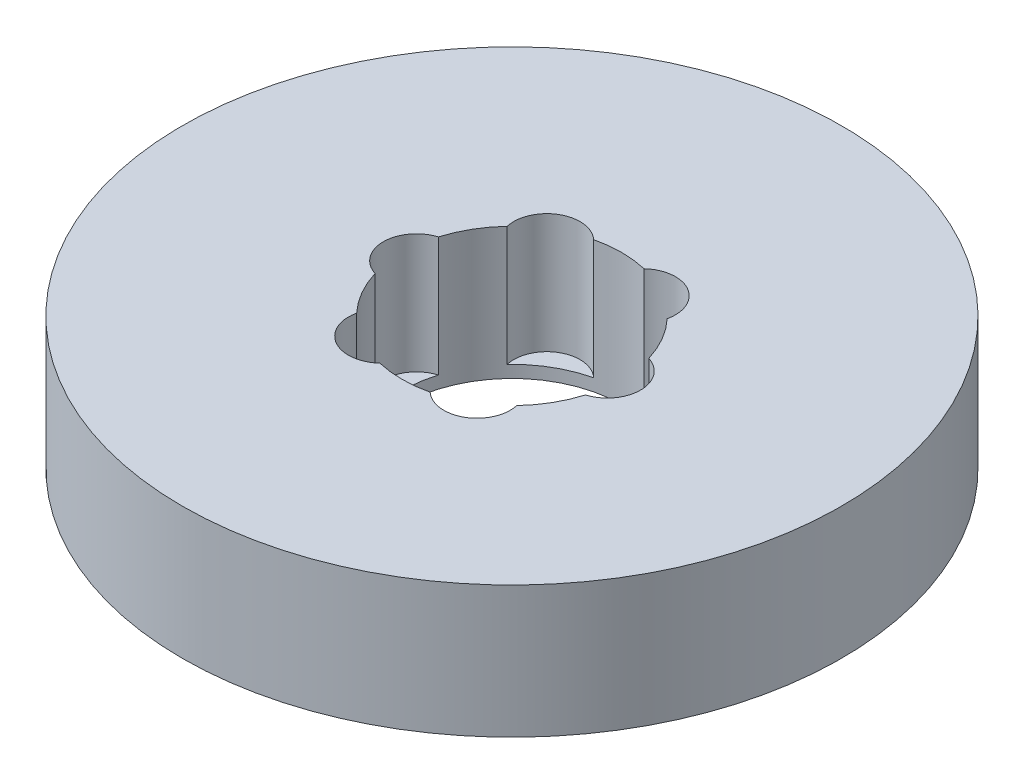
ISO-10303-21;
HEADER;
FILE_DESCRIPTION(('STEP AP214'),'2;1');
FILE_NAME('part.step','',(''),(''),'','','');
FILE_SCHEMA(('AUTOMOTIVE_DESIGN { 1 0 10303 214 1 1 1 1 }'));
ENDSEC;
DATA;
#1=APPLICATION_CONTEXT('core data for automotive mechanical design processes');
#2=APPLICATION_PROTOCOL_DEFINITION('international standard','automotive_design',2000,#1);
#3=PRODUCT_CONTEXT('',#1,'mechanical');
#4=PRODUCT('Part','Part','',(#3));
#5=PRODUCT_RELATED_PRODUCT_CATEGORY('part','',(#4));
#6=PRODUCT_DEFINITION_FORMATION('','',#4);
#7=PRODUCT_DEFINITION_CONTEXT('part definition',#1,'design');
#8=PRODUCT_DEFINITION('design','',#6,#7);
#9=PRODUCT_DEFINITION_SHAPE('','',#8);
#10=(LENGTH_UNIT() NAMED_UNIT(*) SI_UNIT(.MILLI.,.METRE.));
#11=(NAMED_UNIT(*) PLANE_ANGLE_UNIT() SI_UNIT($,.RADIAN.));
#12=(NAMED_UNIT(*) SI_UNIT($,.STERADIAN.) SOLID_ANGLE_UNIT());
#13=UNCERTAINTY_MEASURE_WITH_UNIT(LENGTH_MEASURE(1.E-05),#10,'distance_accuracy_value','');
#14=(GEOMETRIC_REPRESENTATION_CONTEXT(3) GLOBAL_UNCERTAINTY_ASSIGNED_CONTEXT((#13)) GLOBAL_UNIT_ASSIGNED_CONTEXT((#10,
#11,#12)) REPRESENTATION_CONTEXT('',''));
#15=CARTESIAN_POINT('',(0.,0.,0.));
#16=DIRECTION('',(0.,0.,1.));
#17=DIRECTION('',(1.,0.,0.));
#18=AXIS2_PLACEMENT_3D('',#15,#16,#17);
#19=CARTESIAN_POINT('',(0.,18.,0.));
#20=DIRECTION('',(0.,-1.,0.));
#21=DIRECTION('',(0.,0.,-1.));
#22=AXIS2_PLACEMENT_3D('',#19,#20,#21);
#23=CYLINDRICAL_SURFACE('',#22,45.);
#24=CARTESIAN_POINT('',(0.,18.,0.));
#25=DIRECTION('',(0.,1.,0.));
#26=DIRECTION('',(0.,0.,1.));
#27=AXIS2_PLACEMENT_3D('',#24,#25,#26);
#28=CIRCLE('',#27,45.);
#29=CARTESIAN_POINT('',(0.,18.,45.));
#30=VERTEX_POINT('',#29);
#31=EDGE_CURVE('E162',#30,#30,#28,.T.);
#32=ORIENTED_EDGE('',*,*,#31,.F.);
#33=EDGE_LOOP('',(#32));
#34=FACE_BOUND('',#33,.T.);
#35=CARTESIAN_POINT('',(0.,0.,0.));
#36=DIRECTION('',(0.,1.,0.));
#37=DIRECTION('',(0.,0.,1.));
#38=AXIS2_PLACEMENT_3D('',#35,#36,#37);
#39=CIRCLE('',#38,45.);
#40=CARTESIAN_POINT('',(0.,0.,45.));
#41=VERTEX_POINT('',#40);
#42=EDGE_CURVE('E157',#41,#41,#39,.T.);
#43=ORIENTED_EDGE('',*,*,#42,.T.);
#44=EDGE_LOOP('',(#43));
#45=FACE_BOUND('',#44,.T.);
#46=ADVANCED_FACE('F39',(#34,#45),#23,.T.);
#47=CARTESIAN_POINT('',(0.,18.,0.));
#48=DIRECTION('',(0.,1.,0.));
#49=DIRECTION('',(0.,0.,1.));
#50=AXIS2_PLACEMENT_3D('',#47,#48,#49);
#51=PLANE('',#50);
#52=CARTESIAN_POINT('',(-6.51524168863489,18.,-11.2847296283062));
#53=DIRECTION('',(0.,1.,0.));
#54=DIRECTION('',(-0.866025403784433,0.,0.50000000000001));
#55=AXIS2_PLACEMENT_3D('',#52,#53,#54);
#56=CIRCLE('',#55,4.52626027528918);
#57=CARTESIAN_POINT('',(-3.43514698347195,18.,-14.601361758478));
#58=VERTEX_POINT('',#57);
#59=CARTESIAN_POINT('',(-10.9275767209528,18.,-10.2756054326589));
#60=VERTEX_POINT('',#59);
#61=EDGE_CURVE('E218',#58,#60,#56,.T.);
#62=ORIENTED_EDGE('',*,*,#61,.F.);
#63=CARTESIAN_POINT('',(0.,18.,0.));
#64=DIRECTION('',(0.,1.,0.));
#65=DIRECTION('',(0.,0.,1.));
#66=AXIS2_PLACEMENT_3D('',#63,#64,#65);
#67=CIRCLE('',#66,15.);
#68=CARTESIAN_POINT('',(3.43514698347164,18.,-14.6013617584781));
#69=VERTEX_POINT('',#68);
#70=EDGE_CURVE('E169',#69,#58,#67,.T.);
#71=ORIENTED_EDGE('',*,*,#70,.F.);
#72=CARTESIAN_POINT('',(6.51524168863465,18.,-11.2847296283063));
#73=DIRECTION('',(0.,1.,0.));
#74=DIRECTION('',(-0.866025403784443,0.,-0.499999999999992));
#75=AXIS2_PLACEMENT_3D('',#72,#73,#74);
#76=CIRCLE('',#75,4.52626027528918);
#77=CARTESIAN_POINT('',(10.9275767209526,18.,-10.2756054326592));
#78=VERTEX_POINT('',#77);
#79=EDGE_CURVE('E285',#78,#69,#76,.T.);
#80=ORIENTED_EDGE('',*,*,#79,.F.);
#81=CARTESIAN_POINT('',(14.3627237044245,18.,-4.32575632581898));
#82=VERTEX_POINT('',#81);
#83=EDGE_CURVE('E174',#82,#78,#67,.T.);
#84=ORIENTED_EDGE('',*,*,#83,.F.);
#85=CARTESIAN_POINT('',(13.0304833772695,18.,0.));
#86=DIRECTION('',(0.,1.,0.));
#87=DIRECTION('',(0.,0.,-1.));
#88=AXIS2_PLACEMENT_3D('',#85,#86,#87);
#89=CIRCLE('',#88,4.52626027528918);
#90=CARTESIAN_POINT('',(14.3627237044245,18.,4.32575632581898));
#91=VERTEX_POINT('',#90);
#92=EDGE_CURVE('E280',#91,#82,#89,.T.);
#93=ORIENTED_EDGE('',*,*,#92,.F.);
#94=CARTESIAN_POINT('',(10.9275767209528,18.,10.275605432659));
#95=VERTEX_POINT('',#94);
#96=EDGE_CURVE('E164',#95,#91,#67,.T.);
#97=ORIENTED_EDGE('',*,*,#96,.F.);
#98=CARTESIAN_POINT('',(6.51524168863481,18.,11.2847296283062));
#99=DIRECTION('',(0.,1.,0.));
#100=DIRECTION('',(0.866025403784436,0.,-0.500000000000004));
#101=AXIS2_PLACEMENT_3D('',#98,#99,#100);
#102=CIRCLE('',#101,4.52626027528918);
#103=CARTESIAN_POINT('',(3.43514698347184,18.,14.601361758478));
#104=VERTEX_POINT('',#103);
#105=EDGE_CURVE('E269',#104,#95,#102,.T.);
#106=ORIENTED_EDGE('',*,*,#105,.F.);
#107=CARTESIAN_POINT('',(-3.43514698347174,18.,14.601361758478));
#108=VERTEX_POINT('',#107);
#109=EDGE_CURVE('E149',#108,#104,#67,.T.);
#110=ORIENTED_EDGE('',*,*,#109,.F.);
#111=CARTESIAN_POINT('',(-6.51524168863473,18.,11.2847296283063));
#112=DIRECTION('',(0.,1.,0.));
#113=DIRECTION('',(0.86602540378444,0.,0.499999999999998));
#114=AXIS2_PLACEMENT_3D('',#111,#112,#113);
#115=CIRCLE('',#114,4.52626027528918);
#116=CARTESIAN_POINT('',(-10.9275767209527,18.,10.2756054326591));
#117=VERTEX_POINT('',#116);
#118=EDGE_CURVE('E128',#117,#108,#115,.T.);
#119=ORIENTED_EDGE('',*,*,#118,.F.);
#120=CARTESIAN_POINT('',(-14.3627237044245,18.,4.32575632581898));
#121=VERTEX_POINT('',#120);
#122=EDGE_CURVE('E148',#121,#117,#67,.T.);
#123=ORIENTED_EDGE('',*,*,#122,.F.);
#124=CARTESIAN_POINT('',(-13.0304833772695,18.,0.));
#125=DIRECTION('',(0.,1.,0.));
#126=DIRECTION('',(0.,0.,1.));
#127=AXIS2_PLACEMENT_3D('',#124,#125,#126);
#128=CIRCLE('',#127,4.52626027528918);
#129=CARTESIAN_POINT('',(-14.3627237044245,18.,-4.32575632581898));
#130=VERTEX_POINT('',#129);
#131=EDGE_CURVE('E179',#130,#121,#128,.T.);
#132=ORIENTED_EDGE('',*,*,#131,.F.);
#133=EDGE_CURVE('E161',#60,#130,#67,.T.);
#134=ORIENTED_EDGE('',*,*,#133,.F.);
#135=EDGE_LOOP('',(#62,#71,#80,#84,#93,#97,#106,#110,#119,#123,#132,#134));
#136=FACE_BOUND('',#135,.T.);
#137=ORIENTED_EDGE('',*,*,#31,.T.);
#138=EDGE_LOOP('',(#137));
#139=FACE_BOUND('',#138,.T.);
#140=ADVANCED_FACE('F141',(#136,#139),#51,.T.);
#141=CARTESIAN_POINT('',(0.,0.,0.));
#142=DIRECTION('',(0.,1.,0.));
#143=DIRECTION('',(0.,0.,1.));
#144=AXIS2_PLACEMENT_3D('',#141,#142,#143);
#145=PLANE('',#144);
#146=CARTESIAN_POINT('',(0.,0.,0.));
#147=DIRECTION('',(0.,1.,0.));
#148=DIRECTION('',(0.,0.,1.));
#149=AXIS2_PLACEMENT_3D('',#146,#147,#148);
#150=CIRCLE('',#149,15.);
#151=CARTESIAN_POINT('',(0.,0.,15.));
#152=VERTEX_POINT('',#151);
#153=EDGE_CURVE('E166',#152,#152,#150,.T.);
#154=ORIENTED_EDGE('',*,*,#153,.T.);
#155=EDGE_LOOP('',(#154));
#156=FACE_BOUND('',#155,.T.);
#157=ORIENTED_EDGE('',*,*,#42,.F.);
#158=EDGE_LOOP('',(#157));
#159=FACE_BOUND('',#158,.T.);
#160=ADVANCED_FACE('F234',(#156,#159),#145,.F.);
#161=CARTESIAN_POINT('',(0.,18.,0.));
#162=DIRECTION('',(0.,-1.,0.));
#163=DIRECTION('',(0.,0.,-1.));
#164=AXIS2_PLACEMENT_3D('',#161,#162,#163);
#165=CYLINDRICAL_SURFACE('',#164,15.);
#166=DIRECTION('',(0.,1.,0.));
#167=VECTOR('',#166,1.);
#168=CARTESIAN_POINT('',(-3.43514698347195,9.83649902782655,-14.601361758478));
#169=LINE('',#168,#167);
#170=CARTESIAN_POINT('',(-3.43514698347195,1.6729980556531,-14.601361758478));
#171=VERTEX_POINT('',#170);
#172=EDGE_CURVE('E11',#171,#58,#169,.T.);
#173=ORIENTED_EDGE('',*,*,#172,.F.);
#174=CARTESIAN_POINT('',(0.,1.6729980556531,0.));
#175=DIRECTION('',(0.,1.,0.));
#176=DIRECTION('',(0.,0.,1.));
#177=AXIS2_PLACEMENT_3D('',#174,#175,#176);
#178=CIRCLE('',#177,15.);
#179=CARTESIAN_POINT('',(-10.9275767209528,1.6729980556531,-10.2756054326589));
#180=VERTEX_POINT('',#179);
#181=EDGE_CURVE('E214',#171,#180,#178,.T.);
#182=ORIENTED_EDGE('',*,*,#181,.T.);
#183=DIRECTION('',(0.,1.,0.));
#184=VECTOR('',#183,1.);
#185=CARTESIAN_POINT('',(-10.9275767209528,9.83649902782655,-10.2756054326589));
#186=LINE('',#185,#184);
#187=EDGE_CURVE('E46',#60,#180,#186,.F.);
#188=ORIENTED_EDGE('',*,*,#187,.F.);
#189=ORIENTED_EDGE('',*,*,#133,.T.);
#190=DIRECTION('',(0.,1.,0.));
#191=VECTOR('',#190,1.);
#192=CARTESIAN_POINT('',(-14.3627237044245,9.83649902782655,-4.32575632581898));
#193=LINE('',#192,#191);
#194=CARTESIAN_POINT('',(-14.3627237044245,1.6729980556531,-4.32575632581898));
#195=VERTEX_POINT('',#194);
#196=EDGE_CURVE('E187',#195,#130,#193,.T.);
#197=ORIENTED_EDGE('',*,*,#196,.F.);
#198=CARTESIAN_POINT('',(0.,1.6729980556531,0.));
#199=DIRECTION('',(0.,1.,0.));
#200=DIRECTION('',(0.,0.,1.));
#201=AXIS2_PLACEMENT_3D('',#198,#199,#200);
#202=CIRCLE('',#201,15.);
#203=CARTESIAN_POINT('',(-14.3627237044245,1.6729980556531,4.32575632581898));
#204=VERTEX_POINT('',#203);
#205=EDGE_CURVE('E184',#195,#204,#202,.T.);
#206=ORIENTED_EDGE('',*,*,#205,.T.);
#207=DIRECTION('',(0.,1.,0.));
#208=VECTOR('',#207,1.);
#209=CARTESIAN_POINT('',(-14.3627237044245,9.83649902782655,4.32575632581898));
#210=LINE('',#209,#208);
#211=EDGE_CURVE('E158',#121,#204,#210,.F.);
#212=ORIENTED_EDGE('',*,*,#211,.F.);
#213=ORIENTED_EDGE('',*,*,#122,.T.);
#214=DIRECTION('',(0.,1.,0.));
#215=VECTOR('',#214,1.);
#216=CARTESIAN_POINT('',(-10.9275767209527,9.83649902782655,10.2756054326591));
#217=LINE('',#216,#215);
#218=CARTESIAN_POINT('',(-10.9275767209527,1.6729980556531,10.2756054326591));
#219=VERTEX_POINT('',#218);
#220=EDGE_CURVE('E127',#219,#117,#217,.T.);
#221=ORIENTED_EDGE('',*,*,#220,.F.);
#222=CARTESIAN_POINT('',(0.,1.6729980556531,0.));
#223=DIRECTION('',(0.,1.,0.));
#224=DIRECTION('',(0.,0.,1.));
#225=AXIS2_PLACEMENT_3D('',#222,#223,#224);
#226=CIRCLE('',#225,15.);
#227=CARTESIAN_POINT('',(-3.43514698347174,1.6729980556531,14.601361758478));
#228=VERTEX_POINT('',#227);
#229=EDGE_CURVE('E189',#219,#228,#226,.T.);
#230=ORIENTED_EDGE('',*,*,#229,.T.);
#231=DIRECTION('',(0.,1.,0.));
#232=VECTOR('',#231,1.);
#233=CARTESIAN_POINT('',(-3.43514698347174,9.83649902782655,14.601361758478));
#234=LINE('',#233,#232);
#235=EDGE_CURVE('E140',#108,#228,#234,.F.);
#236=ORIENTED_EDGE('',*,*,#235,.F.);
#237=ORIENTED_EDGE('',*,*,#109,.T.);
#238=DIRECTION('',(0.,1.,0.));
#239=VECTOR('',#238,1.);
#240=CARTESIAN_POINT('',(3.43514698347184,9.83649902782655,14.601361758478));
#241=LINE('',#240,#239);
#242=CARTESIAN_POINT('',(3.43514698347184,1.6729980556531,14.601361758478));
#243=VERTEX_POINT('',#242);
#244=EDGE_CURVE('E196',#243,#104,#241,.T.);
#245=ORIENTED_EDGE('',*,*,#244,.F.);
#246=CARTESIAN_POINT('',(0.,1.6729980556531,0.));
#247=DIRECTION('',(0.,1.,0.));
#248=DIRECTION('',(0.,0.,1.));
#249=AXIS2_PLACEMENT_3D('',#246,#247,#248);
#250=CIRCLE('',#249,15.);
#251=CARTESIAN_POINT('',(10.9275767209528,1.6729980556531,10.275605432659));
#252=VERTEX_POINT('',#251);
#253=EDGE_CURVE('E136',#243,#252,#250,.T.);
#254=ORIENTED_EDGE('',*,*,#253,.T.);
#255=DIRECTION('',(0.,1.,0.));
#256=VECTOR('',#255,1.);
#257=CARTESIAN_POINT('',(10.9275767209528,9.83649902782655,10.275605432659));
#258=LINE('',#257,#256);
#259=EDGE_CURVE('E194',#95,#252,#258,.F.);
#260=ORIENTED_EDGE('',*,*,#259,.F.);
#261=ORIENTED_EDGE('',*,*,#96,.T.);
#262=DIRECTION('',(0.,1.,0.));
#263=VECTOR('',#262,1.);
#264=CARTESIAN_POINT('',(14.3627237044245,9.83649902782655,4.32575632581898));
#265=LINE('',#264,#263);
#266=CARTESIAN_POINT('',(14.3627237044245,1.6729980556531,4.32575632581898));
#267=VERTEX_POINT('',#266);
#268=EDGE_CURVE('E206',#267,#91,#265,.T.);
#269=ORIENTED_EDGE('',*,*,#268,.F.);
#270=CARTESIAN_POINT('',(0.,1.6729980556531,0.));
#271=DIRECTION('',(0.,1.,0.));
#272=DIRECTION('',(0.,0.,1.));
#273=AXIS2_PLACEMENT_3D('',#270,#271,#272);
#274=CIRCLE('',#273,15.);
#275=CARTESIAN_POINT('',(14.3627237044245,1.6729980556531,-4.32575632581898));
#276=VERTEX_POINT('',#275);
#277=EDGE_CURVE('E199',#267,#276,#274,.T.);
#278=ORIENTED_EDGE('',*,*,#277,.T.);
#279=DIRECTION('',(0.,1.,0.));
#280=VECTOR('',#279,1.);
#281=CARTESIAN_POINT('',(14.3627237044245,9.83649902782655,-4.32575632581898));
#282=LINE('',#281,#280);
#283=EDGE_CURVE('E201',#82,#276,#282,.F.);
#284=ORIENTED_EDGE('',*,*,#283,.F.);
#285=ORIENTED_EDGE('',*,*,#83,.T.);
#286=DIRECTION('',(0.,1.,0.));
#287=VECTOR('',#286,1.);
#288=CARTESIAN_POINT('',(10.9275767209526,9.83649902782655,-10.2756054326592));
#289=LINE('',#288,#287);
#290=CARTESIAN_POINT('',(10.9275767209526,1.6729980556531,-10.2756054326592));
#291=VERTEX_POINT('',#290);
#292=EDGE_CURVE('E213',#291,#78,#289,.T.);
#293=ORIENTED_EDGE('',*,*,#292,.F.);
#294=CARTESIAN_POINT('',(0.,1.6729980556531,0.));
#295=DIRECTION('',(0.,1.,0.));
#296=DIRECTION('',(0.,0.,1.));
#297=AXIS2_PLACEMENT_3D('',#294,#295,#296);
#298=CIRCLE('',#297,15.);
#299=CARTESIAN_POINT('',(3.43514698347164,1.6729980556531,-14.6013617584781));
#300=VERTEX_POINT('',#299);
#301=EDGE_CURVE('E208',#291,#300,#298,.T.);
#302=ORIENTED_EDGE('',*,*,#301,.T.);
#303=DIRECTION('',(0.,1.,0.));
#304=VECTOR('',#303,1.);
#305=CARTESIAN_POINT('',(3.43514698347164,9.83649902782655,-14.6013617584781));
#306=LINE('',#305,#304);
#307=EDGE_CURVE('E211',#69,#300,#306,.F.);
#308=ORIENTED_EDGE('',*,*,#307,.F.);
#309=ORIENTED_EDGE('',*,*,#70,.T.);
#310=EDGE_LOOP('',(#173,#182,#188,#189,#197,#206,#212,#213,#221,#230,#236,#237,#245,#254,#260,
#261,#269,#278,#284,#285,#293,#302,#308,#309));
#311=FACE_BOUND('',#310,.T.);
#312=ORIENTED_EDGE('',*,*,#153,.F.);
#313=EDGE_LOOP('',(#312));
#314=FACE_BOUND('',#313,.T.);
#315=ADVANCED_FACE('F152',(#311,#314),#165,.F.);
#316=CARTESIAN_POINT('',(-13.0304833772695,1.6729980556531,0.));
#317=DIRECTION('',(0.,1.,0.));
#318=DIRECTION('',(0.,0.,1.));
#319=AXIS2_PLACEMENT_3D('',#316,#317,#318);
#320=CYLINDRICAL_SURFACE('',#319,4.52626027528918);
#321=ORIENTED_EDGE('',*,*,#196,.T.);
#322=ORIENTED_EDGE('',*,*,#131,.T.);
#323=ORIENTED_EDGE('',*,*,#211,.T.);
#324=CARTESIAN_POINT('',(-13.0304833772695,1.6729980556531,0.));
#325=DIRECTION('',(0.,1.,0.));
#326=DIRECTION('',(0.,0.,1.));
#327=AXIS2_PLACEMENT_3D('',#324,#325,#326);
#328=CIRCLE('',#327,4.52626027528918);
#329=EDGE_CURVE('E180',#195,#204,#328,.T.);
#330=ORIENTED_EDGE('',*,*,#329,.F.);
#331=EDGE_LOOP('',(#321,#322,#323,#330));
#332=FACE_BOUND('',#331,.T.);
#333=ADVANCED_FACE('F244',(#332),#320,.F.);
#334=CARTESIAN_POINT('',(-13.0304833772695,1.6729980556531,0.));
#335=DIRECTION('',(0.,1.,0.));
#336=DIRECTION('',(0.,0.,1.));
#337=AXIS2_PLACEMENT_3D('',#334,#335,#336);
#338=PLANE('',#337);
#339=ORIENTED_EDGE('',*,*,#329,.T.);
#340=ORIENTED_EDGE('',*,*,#205,.F.);
#341=EDGE_LOOP('',(#339,#340));
#342=FACE_BOUND('',#341,.T.);
#343=ADVANCED_FACE('F248',(#342),#338,.T.);
#344=CARTESIAN_POINT('',(-6.51524168863473,1.6729980556531,11.2847296283063));
#345=DIRECTION('',(0.,1.,0.));
#346=DIRECTION('',(0.,0.,1.));
#347=AXIS2_PLACEMENT_3D('',#344,#345,#346);
#348=CYLINDRICAL_SURFACE('',#347,4.52626027528918);
#349=ORIENTED_EDGE('',*,*,#220,.T.);
#350=ORIENTED_EDGE('',*,*,#118,.T.);
#351=ORIENTED_EDGE('',*,*,#235,.T.);
#352=CARTESIAN_POINT('',(-6.51524168863473,1.6729980556531,11.2847296283063));
#353=DIRECTION('',(0.,1.,0.));
#354=DIRECTION('',(0.86602540378444,0.,0.499999999999998));
#355=AXIS2_PLACEMENT_3D('',#352,#353,#354);
#356=CIRCLE('',#355,4.52626027528918);
#357=EDGE_CURVE('E135',#219,#228,#356,.T.);
#358=ORIENTED_EDGE('',*,*,#357,.F.);
#359=EDGE_LOOP('',(#349,#350,#351,#358));
#360=FACE_BOUND('',#359,.T.);
#361=ADVANCED_FACE('F126',(#360),#348,.F.);
#362=CARTESIAN_POINT('',(-6.51524168863473,1.6729980556531,11.2847296283063));
#363=DIRECTION('',(0.,1.,0.));
#364=DIRECTION('',(0.86602540378444,0.,0.499999999999998));
#365=AXIS2_PLACEMENT_3D('',#362,#363,#364);
#366=PLANE('',#365);
#367=ORIENTED_EDGE('',*,*,#357,.T.);
#368=ORIENTED_EDGE('',*,*,#229,.F.);
#369=EDGE_LOOP('',(#367,#368));
#370=FACE_BOUND('',#369,.T.);
#371=ADVANCED_FACE('F258',(#370),#366,.T.);
#372=CARTESIAN_POINT('',(6.51524168863481,1.6729980556531,11.2847296283062));
#373=DIRECTION('',(0.,1.,0.));
#374=DIRECTION('',(0.,0.,1.));
#375=AXIS2_PLACEMENT_3D('',#372,#373,#374);
#376=CYLINDRICAL_SURFACE('',#375,4.52626027528918);
#377=ORIENTED_EDGE('',*,*,#244,.T.);
#378=ORIENTED_EDGE('',*,*,#105,.T.);
#379=ORIENTED_EDGE('',*,*,#259,.T.);
#380=CARTESIAN_POINT('',(6.51524168863481,1.6729980556531,11.2847296283062));
#381=DIRECTION('',(0.,1.,0.));
#382=DIRECTION('',(0.866025403784436,0.,-0.500000000000004));
#383=AXIS2_PLACEMENT_3D('',#380,#381,#382);
#384=CIRCLE('',#383,4.52626027528918);
#385=EDGE_CURVE('E147',#243,#252,#384,.T.);
#386=ORIENTED_EDGE('',*,*,#385,.F.);
#387=EDGE_LOOP('',(#377,#378,#379,#386));
#388=FACE_BOUND('',#387,.T.);
#389=ADVANCED_FACE('F256',(#388),#376,.F.);
#390=CARTESIAN_POINT('',(6.51524168863481,1.6729980556531,11.2847296283062));
#391=DIRECTION('',(0.,1.,0.));
#392=DIRECTION('',(0.866025403784436,0.,-0.500000000000004));
#393=AXIS2_PLACEMENT_3D('',#390,#391,#392);
#394=PLANE('',#393);
#395=ORIENTED_EDGE('',*,*,#385,.T.);
#396=ORIENTED_EDGE('',*,*,#253,.F.);
#397=EDGE_LOOP('',(#395,#396));
#398=FACE_BOUND('',#397,.T.);
#399=ADVANCED_FACE('F263',(#398),#394,.T.);
#400=CARTESIAN_POINT('',(13.0304833772695,1.6729980556531,0.));
#401=DIRECTION('',(0.,1.,0.));
#402=DIRECTION('',(0.,0.,1.));
#403=AXIS2_PLACEMENT_3D('',#400,#401,#402);
#404=CYLINDRICAL_SURFACE('',#403,4.52626027528918);
#405=ORIENTED_EDGE('',*,*,#268,.T.);
#406=ORIENTED_EDGE('',*,*,#92,.T.);
#407=ORIENTED_EDGE('',*,*,#283,.T.);
#408=CARTESIAN_POINT('',(13.0304833772695,1.6729980556531,0.));
#409=DIRECTION('',(0.,1.,0.));
#410=DIRECTION('',(0.,0.,-1.));
#411=AXIS2_PLACEMENT_3D('',#408,#409,#410);
#412=CIRCLE('',#411,4.52626027528918);
#413=EDGE_CURVE('E273',#267,#276,#412,.T.);
#414=ORIENTED_EDGE('',*,*,#413,.F.);
#415=EDGE_LOOP('',(#405,#406,#407,#414));
#416=FACE_BOUND('',#415,.T.);
#417=ADVANCED_FACE('F297',(#416),#404,.F.);
#418=CARTESIAN_POINT('',(13.0304833772695,1.6729980556531,0.));
#419=DIRECTION('',(0.,1.,0.));
#420=DIRECTION('',(0.,0.,-1.));
#421=AXIS2_PLACEMENT_3D('',#418,#419,#420);
#422=PLANE('',#421);
#423=ORIENTED_EDGE('',*,*,#413,.T.);
#424=ORIENTED_EDGE('',*,*,#277,.F.);
#425=EDGE_LOOP('',(#423,#424));
#426=FACE_BOUND('',#425,.T.);
#427=ADVANCED_FACE('F299',(#426),#422,.T.);
#428=CARTESIAN_POINT('',(6.51524168863465,1.6729980556531,-11.2847296283063));
#429=DIRECTION('',(0.,1.,0.));
#430=DIRECTION('',(0.,0.,1.));
#431=AXIS2_PLACEMENT_3D('',#428,#429,#430);
#432=CYLINDRICAL_SURFACE('',#431,4.52626027528918);
#433=ORIENTED_EDGE('',*,*,#292,.T.);
#434=ORIENTED_EDGE('',*,*,#79,.T.);
#435=ORIENTED_EDGE('',*,*,#307,.T.);
#436=CARTESIAN_POINT('',(6.51524168863465,1.6729980556531,-11.2847296283063));
#437=DIRECTION('',(0.,1.,0.));
#438=DIRECTION('',(-0.866025403784443,0.,-0.499999999999992));
#439=AXIS2_PLACEMENT_3D('',#436,#437,#438);
#440=CIRCLE('',#439,4.52626027528918);
#441=EDGE_CURVE('E56',#291,#300,#440,.T.);
#442=ORIENTED_EDGE('',*,*,#441,.F.);
#443=EDGE_LOOP('',(#433,#434,#435,#442));
#444=FACE_BOUND('',#443,.T.);
#445=ADVANCED_FACE('F292',(#444),#432,.F.);
#446=CARTESIAN_POINT('',(6.51524168863465,1.6729980556531,-11.2847296283063));
#447=DIRECTION('',(0.,1.,0.));
#448=DIRECTION('',(-0.866025403784443,0.,-0.499999999999992));
#449=AXIS2_PLACEMENT_3D('',#446,#447,#448);
#450=PLANE('',#449);
#451=ORIENTED_EDGE('',*,*,#441,.T.);
#452=ORIENTED_EDGE('',*,*,#301,.F.);
#453=EDGE_LOOP('',(#451,#452));
#454=FACE_BOUND('',#453,.T.);
#455=ADVANCED_FACE('F226',(#454),#450,.T.);
#456=CARTESIAN_POINT('',(-6.51524168863489,1.6729980556531,-11.2847296283062));
#457=DIRECTION('',(0.,1.,0.));
#458=DIRECTION('',(0.,0.,1.));
#459=AXIS2_PLACEMENT_3D('',#456,#457,#458);
#460=CYLINDRICAL_SURFACE('',#459,4.52626027528918);
#461=ORIENTED_EDGE('',*,*,#172,.T.);
#462=ORIENTED_EDGE('',*,*,#61,.T.);
#463=ORIENTED_EDGE('',*,*,#187,.T.);
#464=CARTESIAN_POINT('',(-6.51524168863489,1.6729980556531,-11.2847296283062));
#465=DIRECTION('',(0.,1.,0.));
#466=DIRECTION('',(-0.866025403784433,0.,0.50000000000001));
#467=AXIS2_PLACEMENT_3D('',#464,#465,#466);
#468=CIRCLE('',#467,4.52626027528918);
#469=EDGE_CURVE('E55',#171,#180,#468,.T.);
#470=ORIENTED_EDGE('',*,*,#469,.F.);
#471=EDGE_LOOP('',(#461,#462,#463,#470));
#472=FACE_BOUND('',#471,.T.);
#473=ADVANCED_FACE('F217',(#472),#460,.F.);
#474=CARTESIAN_POINT('',(-6.51524168863489,1.6729980556531,-11.2847296283062));
#475=DIRECTION('',(0.,1.,0.));
#476=DIRECTION('',(-0.866025403784433,0.,0.50000000000001));
#477=AXIS2_PLACEMENT_3D('',#474,#475,#476);
#478=PLANE('',#477);
#479=ORIENTED_EDGE('',*,*,#469,.T.);
#480=ORIENTED_EDGE('',*,*,#181,.F.);
#481=EDGE_LOOP('',(#479,#480));
#482=FACE_BOUND('',#481,.T.);
#483=ADVANCED_FACE('F219',(#482),#478,.T.);
#484=CLOSED_SHELL('',(#46,#140,#160,#315,#333,#343,#361,#371,#389,#399,#417,#427,#445,#455,#473,#483));
#485=MANIFOLD_SOLID_BREP('B2',#484);
#486=ADVANCED_BREP_SHAPE_REPRESENTATION('',(#18,#485),#14);
#487=SHAPE_DEFINITION_REPRESENTATION(#9,#486);
ENDSEC;
END-ISO-10303-21;
